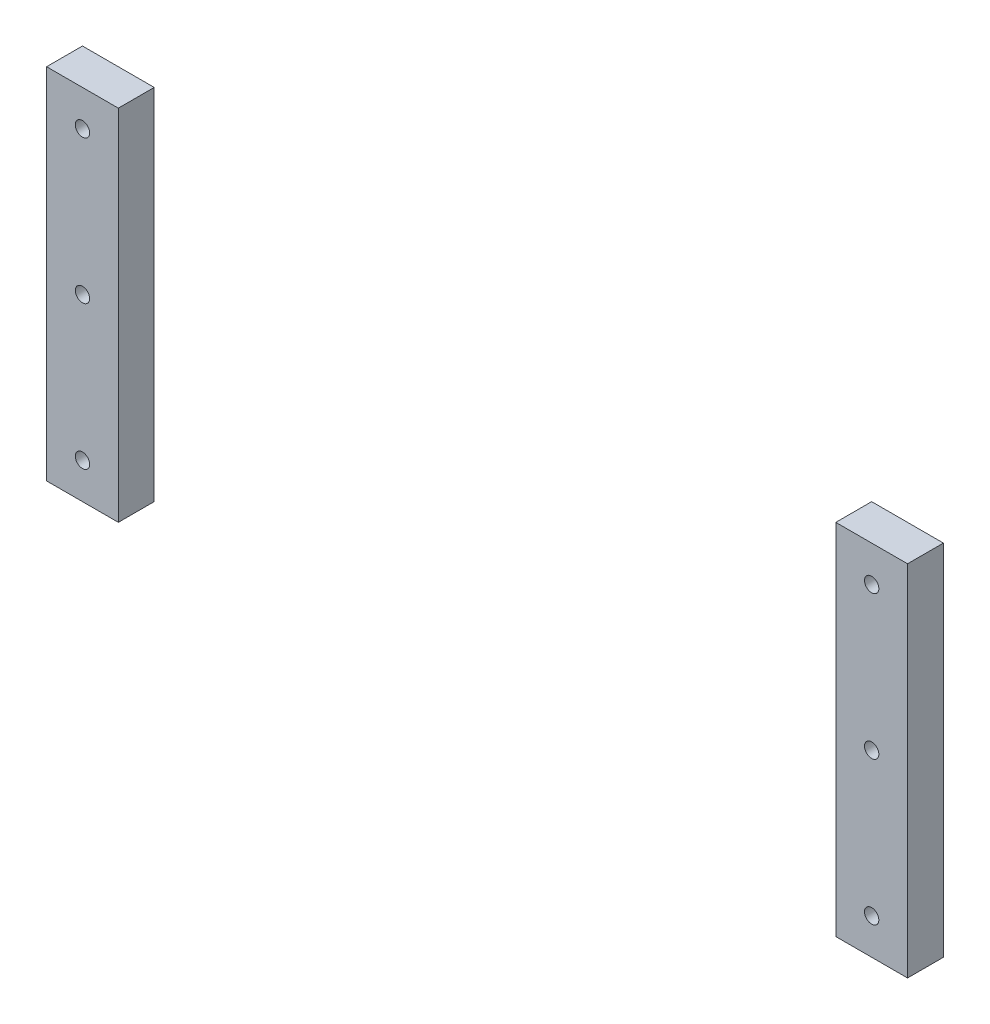
ISO-10303-21;
HEADER;
FILE_DESCRIPTION(('STEP AP214'),'2;1');
FILE_NAME('part.step','',(''),(''),'','','');
FILE_SCHEMA(('AUTOMOTIVE_DESIGN { 1 0 10303 214 1 1 1 1 }'));
ENDSEC;
DATA;
#1=APPLICATION_CONTEXT('core data for automotive mechanical design processes');
#2=APPLICATION_PROTOCOL_DEFINITION('international standard','automotive_design',2000,#1);
#3=PRODUCT_CONTEXT('',#1,'mechanical');
#4=PRODUCT('Part','Part','',(#3));
#5=PRODUCT_RELATED_PRODUCT_CATEGORY('part','',(#4));
#6=PRODUCT_DEFINITION_FORMATION('','',#4);
#7=PRODUCT_DEFINITION_CONTEXT('part definition',#1,'design');
#8=PRODUCT_DEFINITION('design','',#6,#7);
#9=PRODUCT_DEFINITION_SHAPE('','',#8);
#10=(LENGTH_UNIT() NAMED_UNIT(*) SI_UNIT(.MILLI.,.METRE.));
#11=(NAMED_UNIT(*) PLANE_ANGLE_UNIT() SI_UNIT($,.RADIAN.));
#12=(NAMED_UNIT(*) SI_UNIT($,.STERADIAN.) SOLID_ANGLE_UNIT());
#13=UNCERTAINTY_MEASURE_WITH_UNIT(LENGTH_MEASURE(1.E-05),#10,'distance_accuracy_value','');
#14=(GEOMETRIC_REPRESENTATION_CONTEXT(3) GLOBAL_UNCERTAINTY_ASSIGNED_CONTEXT((#13)) GLOBAL_UNIT_ASSIGNED_CONTEXT((#10,
#11,#12)) REPRESENTATION_CONTEXT('',''));
#15=CARTESIAN_POINT('',(0.,0.,0.));
#16=DIRECTION('',(0.,0.,1.));
#17=DIRECTION('',(1.,0.,0.));
#18=AXIS2_PLACEMENT_3D('',#15,#16,#17);
#19=CARTESIAN_POINT('',(200.,0.,10.));
#20=DIRECTION('',(1.,0.,0.));
#21=DIRECTION('',(0.,0.,-1.));
#22=AXIS2_PLACEMENT_3D('',#19,#20,#21);
#23=PLANE('',#22);
#24=DIRECTION('',(0.,-1.,0.));
#25=VECTOR('',#24,1.);
#26=CARTESIAN_POINT('',(200.,0.,0.));
#27=LINE('',#26,#25);
#28=CARTESIAN_POINT('',(200.,100.,0.));
#29=VERTEX_POINT('',#28);
#30=CARTESIAN_POINT('',(200.,0.,0.));
#31=VERTEX_POINT('',#30);
#32=EDGE_CURVE('E110',#29,#31,#27,.T.);
#33=ORIENTED_EDGE('',*,*,#32,.T.);
#34=DIRECTION('',(0.,0.,-1.));
#35=VECTOR('',#34,1.);
#36=CARTESIAN_POINT('',(200.,0.,10.));
#37=LINE('',#36,#35);
#38=CARTESIAN_POINT('',(200.,0.,10.));
#39=VERTEX_POINT('',#38);
#40=EDGE_CURVE('E12',#39,#31,#37,.T.);
#41=ORIENTED_EDGE('',*,*,#40,.F.);
#42=DIRECTION('',(0.,-1.,0.));
#43=VECTOR('',#42,1.);
#44=CARTESIAN_POINT('',(200.,0.,10.));
#45=LINE('',#44,#43);
#46=CARTESIAN_POINT('',(200.,100.,10.));
#47=VERTEX_POINT('',#46);
#48=EDGE_CURVE('E98',#47,#39,#45,.T.);
#49=ORIENTED_EDGE('',*,*,#48,.F.);
#50=DIRECTION('',(0.,0.,-1.));
#51=VECTOR('',#50,1.);
#52=CARTESIAN_POINT('',(200.,100.,10.));
#53=LINE('',#52,#51);
#54=EDGE_CURVE('E106',#47,#29,#53,.T.);
#55=ORIENTED_EDGE('',*,*,#54,.T.);
#56=EDGE_LOOP('',(#33,#41,#49,#55));
#57=FACE_BOUND('',#56,.T.);
#58=ADVANCED_FACE('F47',(#57),#23,.F.);
#59=CARTESIAN_POINT('',(200.,0.,10.));
#60=DIRECTION('',(0.,1.,0.));
#61=DIRECTION('',(0.,0.,1.));
#62=AXIS2_PLACEMENT_3D('',#59,#60,#61);
#63=PLANE('',#62);
#64=DIRECTION('',(1.,0.,0.));
#65=VECTOR('',#64,1.);
#66=CARTESIAN_POINT('',(200.,0.,0.));
#67=LINE('',#66,#65);
#68=CARTESIAN_POINT('',(220.,0.,0.));
#69=VERTEX_POINT('',#68);
#70=EDGE_CURVE('E102',#31,#69,#67,.T.);
#71=ORIENTED_EDGE('',*,*,#70,.T.);
#72=DIRECTION('',(0.,0.,-1.));
#73=VECTOR('',#72,1.);
#74=CARTESIAN_POINT('',(220.,0.,10.));
#75=LINE('',#74,#73);
#76=CARTESIAN_POINT('',(220.,0.,10.));
#77=VERTEX_POINT('',#76);
#78=EDGE_CURVE('E55',#77,#69,#75,.T.);
#79=ORIENTED_EDGE('',*,*,#78,.F.);
#80=DIRECTION('',(1.,0.,0.));
#81=VECTOR('',#80,1.);
#82=CARTESIAN_POINT('',(200.,0.,10.));
#83=LINE('',#82,#81);
#84=EDGE_CURVE('E93',#39,#77,#83,.T.);
#85=ORIENTED_EDGE('',*,*,#84,.F.);
#86=ORIENTED_EDGE('',*,*,#40,.T.);
#87=EDGE_LOOP('',(#71,#79,#85,#86));
#88=FACE_BOUND('',#87,.T.);
#89=ADVANCED_FACE('F101',(#88),#63,.F.);
#90=CARTESIAN_POINT('',(220.,0.,10.));
#91=DIRECTION('',(-1.,0.,0.));
#92=DIRECTION('',(0.,0.,1.));
#93=AXIS2_PLACEMENT_3D('',#90,#91,#92);
#94=PLANE('',#93);
#95=DIRECTION('',(0.,1.,0.));
#96=VECTOR('',#95,1.);
#97=CARTESIAN_POINT('',(220.,0.,0.));
#98=LINE('',#97,#96);
#99=CARTESIAN_POINT('',(220.,100.,0.));
#100=VERTEX_POINT('',#99);
#101=EDGE_CURVE('E80',#69,#100,#98,.T.);
#102=ORIENTED_EDGE('',*,*,#101,.T.);
#103=DIRECTION('',(0.,0.,-1.));
#104=VECTOR('',#103,1.);
#105=CARTESIAN_POINT('',(220.,100.,10.));
#106=LINE('',#105,#104);
#107=CARTESIAN_POINT('',(220.,100.,10.));
#108=VERTEX_POINT('',#107);
#109=EDGE_CURVE('E103',#108,#100,#106,.T.);
#110=ORIENTED_EDGE('',*,*,#109,.F.);
#111=DIRECTION('',(0.,1.,0.));
#112=VECTOR('',#111,1.);
#113=CARTESIAN_POINT('',(220.,0.,10.));
#114=LINE('',#113,#112);
#115=EDGE_CURVE('E96',#77,#108,#114,.T.);
#116=ORIENTED_EDGE('',*,*,#115,.F.);
#117=ORIENTED_EDGE('',*,*,#78,.T.);
#118=EDGE_LOOP('',(#102,#110,#116,#117));
#119=FACE_BOUND('',#118,.T.);
#120=ADVANCED_FACE('F104',(#119),#94,.F.);
#121=CARTESIAN_POINT('',(200.,100.,10.));
#122=DIRECTION('',(0.,-1.,0.));
#123=DIRECTION('',(0.,0.,-1.));
#124=AXIS2_PLACEMENT_3D('',#121,#122,#123);
#125=PLANE('',#124);
#126=DIRECTION('',(-1.,0.,0.));
#127=VECTOR('',#126,1.);
#128=CARTESIAN_POINT('',(200.,100.,0.));
#129=LINE('',#128,#127);
#130=EDGE_CURVE('E86',#100,#29,#129,.T.);
#131=ORIENTED_EDGE('',*,*,#130,.T.);
#132=ORIENTED_EDGE('',*,*,#54,.F.);
#133=DIRECTION('',(-1.,0.,0.));
#134=VECTOR('',#133,1.);
#135=CARTESIAN_POINT('',(200.,100.,10.));
#136=LINE('',#135,#134);
#137=EDGE_CURVE('E63',#108,#47,#136,.T.);
#138=ORIENTED_EDGE('',*,*,#137,.F.);
#139=ORIENTED_EDGE('',*,*,#109,.T.);
#140=EDGE_LOOP('',(#131,#132,#138,#139));
#141=FACE_BOUND('',#140,.T.);
#142=ADVANCED_FACE('F118',(#141),#125,.F.);
#143=CARTESIAN_POINT('',(0.,0.,10.));
#144=DIRECTION('',(0.,0.,-1.));
#145=DIRECTION('',(-1.,0.,0.));
#146=AXIS2_PLACEMENT_3D('',#143,#144,#145);
#147=PLANE('',#146);
#148=CARTESIAN_POINT('',(210.,10.,10.));
#149=DIRECTION('',(0.,0.,1.));
#150=DIRECTION('',(-1.,0.,0.));
#151=AXIS2_PLACEMENT_3D('',#148,#149,#150);
#152=CIRCLE('',#151,2.);
#153=CARTESIAN_POINT('',(208.,10.,10.));
#154=VERTEX_POINT('',#153);
#155=EDGE_CURVE('E136',#154,#154,#152,.T.);
#156=ORIENTED_EDGE('',*,*,#155,.F.);
#157=EDGE_LOOP('',(#156));
#158=FACE_BOUND('',#157,.T.);
#159=CARTESIAN_POINT('',(210.,50.,10.));
#160=DIRECTION('',(0.,0.,1.));
#161=DIRECTION('',(-1.,0.,0.));
#162=AXIS2_PLACEMENT_3D('',#159,#160,#161);
#163=CIRCLE('',#162,1.99999999999997);
#164=CARTESIAN_POINT('',(208.,50.,10.));
#165=VERTEX_POINT('',#164);
#166=EDGE_CURVE('E130',#165,#165,#163,.T.);
#167=ORIENTED_EDGE('',*,*,#166,.F.);
#168=EDGE_LOOP('',(#167));
#169=FACE_BOUND('',#168,.T.);
#170=CARTESIAN_POINT('',(210.,90.,10.));
#171=DIRECTION('',(0.,0.,1.));
#172=DIRECTION('',(-1.,0.,0.));
#173=AXIS2_PLACEMENT_3D('',#170,#171,#172);
#174=CIRCLE('',#173,2.00000000000002);
#175=CARTESIAN_POINT('',(208.,90.,10.));
#176=VERTEX_POINT('',#175);
#177=EDGE_CURVE('E124',#176,#176,#174,.T.);
#178=ORIENTED_EDGE('',*,*,#177,.F.);
#179=EDGE_LOOP('',(#178));
#180=FACE_BOUND('',#179,.T.);
#181=ORIENTED_EDGE('',*,*,#48,.T.);
#182=ORIENTED_EDGE('',*,*,#84,.T.);
#183=ORIENTED_EDGE('',*,*,#115,.T.);
#184=ORIENTED_EDGE('',*,*,#137,.T.);
#185=EDGE_LOOP('',(#181,#182,#183,#184));
#186=FACE_BOUND('',#185,.T.);
#187=ADVANCED_FACE('F94',(#158,#169,#180,#186),#147,.F.);
#188=CARTESIAN_POINT('',(0.,0.,0.));
#189=DIRECTION('',(0.,0.,-1.));
#190=DIRECTION('',(-1.,0.,0.));
#191=AXIS2_PLACEMENT_3D('',#188,#189,#190);
#192=PLANE('',#191);
#193=CARTESIAN_POINT('',(210.,10.,0.));
#194=DIRECTION('',(0.,0.,1.));
#195=DIRECTION('',(-1.,0.,0.));
#196=AXIS2_PLACEMENT_3D('',#193,#194,#195);
#197=CIRCLE('',#196,2.);
#198=CARTESIAN_POINT('',(208.,10.,0.));
#199=VERTEX_POINT('',#198);
#200=EDGE_CURVE('E113',#199,#199,#197,.T.);
#201=ORIENTED_EDGE('',*,*,#200,.T.);
#202=EDGE_LOOP('',(#201));
#203=FACE_BOUND('',#202,.T.);
#204=CARTESIAN_POINT('',(210.,50.,0.));
#205=DIRECTION('',(0.,0.,1.));
#206=DIRECTION('',(-1.,0.,0.));
#207=AXIS2_PLACEMENT_3D('',#204,#205,#206);
#208=CIRCLE('',#207,1.99999999999997);
#209=CARTESIAN_POINT('',(208.,50.,0.));
#210=VERTEX_POINT('',#209);
#211=EDGE_CURVE('E133',#210,#210,#208,.T.);
#212=ORIENTED_EDGE('',*,*,#211,.T.);
#213=EDGE_LOOP('',(#212));
#214=FACE_BOUND('',#213,.T.);
#215=CARTESIAN_POINT('',(210.,90.,0.));
#216=DIRECTION('',(0.,0.,1.));
#217=DIRECTION('',(-1.,0.,0.));
#218=AXIS2_PLACEMENT_3D('',#215,#216,#217);
#219=CIRCLE('',#218,2.00000000000002);
#220=CARTESIAN_POINT('',(208.,90.,0.));
#221=VERTEX_POINT('',#220);
#222=EDGE_CURVE('E127',#221,#221,#219,.T.);
#223=ORIENTED_EDGE('',*,*,#222,.T.);
#224=EDGE_LOOP('',(#223));
#225=FACE_BOUND('',#224,.T.);
#226=ORIENTED_EDGE('',*,*,#32,.F.);
#227=ORIENTED_EDGE('',*,*,#130,.F.);
#228=ORIENTED_EDGE('',*,*,#101,.F.);
#229=ORIENTED_EDGE('',*,*,#70,.F.);
#230=EDGE_LOOP('',(#226,#227,#228,#229));
#231=FACE_BOUND('',#230,.T.);
#232=ADVANCED_FACE('F121',(#203,#214,#225,#231),#192,.T.);
#233=CARTESIAN_POINT('',(210.,90.,0.));
#234=DIRECTION('',(0.,0.,1.));
#235=DIRECTION('',(1.,0.,0.));
#236=AXIS2_PLACEMENT_3D('',#233,#234,#235);
#237=CYLINDRICAL_SURFACE('',#236,2.00000000000002);
#238=ORIENTED_EDGE('',*,*,#222,.F.);
#239=EDGE_LOOP('',(#238));
#240=FACE_BOUND('',#239,.T.);
#241=ORIENTED_EDGE('',*,*,#177,.T.);
#242=EDGE_LOOP('',(#241));
#243=FACE_BOUND('',#242,.T.);
#244=ADVANCED_FACE('F158',(#240,#243),#237,.F.);
#245=CARTESIAN_POINT('',(210.,50.,0.));
#246=DIRECTION('',(0.,0.,1.));
#247=DIRECTION('',(1.,0.,0.));
#248=AXIS2_PLACEMENT_3D('',#245,#246,#247);
#249=CYLINDRICAL_SURFACE('',#248,1.99999999999997);
#250=ORIENTED_EDGE('',*,*,#211,.F.);
#251=EDGE_LOOP('',(#250));
#252=FACE_BOUND('',#251,.T.);
#253=ORIENTED_EDGE('',*,*,#166,.T.);
#254=EDGE_LOOP('',(#253));
#255=FACE_BOUND('',#254,.T.);
#256=ADVANCED_FACE('F147',(#252,#255),#249,.F.);
#257=CARTESIAN_POINT('',(210.,10.,0.));
#258=DIRECTION('',(0.,0.,1.));
#259=DIRECTION('',(1.,0.,0.));
#260=AXIS2_PLACEMENT_3D('',#257,#258,#259);
#261=CYLINDRICAL_SURFACE('',#260,2.);
#262=ORIENTED_EDGE('',*,*,#200,.F.);
#263=EDGE_LOOP('',(#262));
#264=FACE_BOUND('',#263,.T.);
#265=ORIENTED_EDGE('',*,*,#155,.T.);
#266=EDGE_LOOP('',(#265));
#267=FACE_BOUND('',#266,.T.);
#268=ADVANCED_FACE('F144',(#264,#267),#261,.F.);
#269=CLOSED_SHELL('',(#58,#89,#120,#142,#187,#232,#244,#256,#268));
#270=MANIFOLD_SOLID_BREP('B2',#269);
#271=CARTESIAN_POINT('',(-20.,0.,10.));
#272=DIRECTION('',(1.,0.,0.));
#273=DIRECTION('',(0.,1.,0.));
#274=AXIS2_PLACEMENT_3D('',#271,#272,#273);
#275=PLANE('',#274);
#276=DIRECTION('',(0.,-1.,0.));
#277=VECTOR('',#276,1.);
#278=CARTESIAN_POINT('',(-20.,0.,0.));
#279=LINE('',#278,#277);
#280=CARTESIAN_POINT('',(-20.,100.,0.));
#281=VERTEX_POINT('',#280);
#282=CARTESIAN_POINT('',(-20.,0.,0.));
#283=VERTEX_POINT('',#282);
#284=EDGE_CURVE('E297',#281,#283,#279,.T.);
#285=ORIENTED_EDGE('',*,*,#284,.T.);
#286=DIRECTION('',(0.,0.,-1.));
#287=VECTOR('',#286,1.);
#288=CARTESIAN_POINT('',(-20.,0.,10.));
#289=LINE('',#288,#287);
#290=CARTESIAN_POINT('',(-20.,0.,10.));
#291=VERTEX_POINT('',#290);
#292=EDGE_CURVE('E45',#291,#283,#289,.T.);
#293=ORIENTED_EDGE('',*,*,#292,.F.);
#294=DIRECTION('',(0.,-1.,0.));
#295=VECTOR('',#294,1.);
#296=CARTESIAN_POINT('',(-20.,0.,10.));
#297=LINE('',#296,#295);
#298=CARTESIAN_POINT('',(-20.,100.,10.));
#299=VERTEX_POINT('',#298);
#300=EDGE_CURVE('E285',#299,#291,#297,.T.);
#301=ORIENTED_EDGE('',*,*,#300,.F.);
#302=DIRECTION('',(0.,0.,-1.));
#303=VECTOR('',#302,1.);
#304=CARTESIAN_POINT('',(-20.,100.,10.));
#305=LINE('',#304,#303);
#306=EDGE_CURVE('E293',#299,#281,#305,.T.);
#307=ORIENTED_EDGE('',*,*,#306,.T.);
#308=EDGE_LOOP('',(#285,#293,#301,#307));
#309=FACE_BOUND('',#308,.T.);
#310=ADVANCED_FACE('F234',(#309),#275,.F.);
#311=CARTESIAN_POINT('',(-20.,0.,10.));
#312=DIRECTION('',(0.,1.,0.));
#313=DIRECTION('',(0.,0.,1.));
#314=AXIS2_PLACEMENT_3D('',#311,#312,#313);
#315=PLANE('',#314);
#316=DIRECTION('',(1.,0.,0.));
#317=VECTOR('',#316,1.);
#318=CARTESIAN_POINT('',(-20.,0.,0.));
#319=LINE('',#318,#317);
#320=CARTESIAN_POINT('',(0.,0.,0.));
#321=VERTEX_POINT('',#320);
#322=EDGE_CURVE('E289',#283,#321,#319,.T.);
#323=ORIENTED_EDGE('',*,*,#322,.T.);
#324=DIRECTION('',(0.,0.,-1.));
#325=VECTOR('',#324,1.);
#326=CARTESIAN_POINT('',(0.,0.,10.));
#327=LINE('',#326,#325);
#328=CARTESIAN_POINT('',(0.,0.,10.));
#329=VERTEX_POINT('',#328);
#330=EDGE_CURVE('E242',#329,#321,#327,.T.);
#331=ORIENTED_EDGE('',*,*,#330,.F.);
#332=DIRECTION('',(1.,0.,0.));
#333=VECTOR('',#332,1.);
#334=CARTESIAN_POINT('',(-20.,0.,10.));
#335=LINE('',#334,#333);
#336=EDGE_CURVE('E280',#291,#329,#335,.T.);
#337=ORIENTED_EDGE('',*,*,#336,.F.);
#338=ORIENTED_EDGE('',*,*,#292,.T.);
#339=EDGE_LOOP('',(#323,#331,#337,#338));
#340=FACE_BOUND('',#339,.T.);
#341=ADVANCED_FACE('F288',(#340),#315,.F.);
#342=CARTESIAN_POINT('',(0.,0.,10.));
#343=DIRECTION('',(-1.,0.,0.));
#344=DIRECTION('',(0.,-1.,0.));
#345=AXIS2_PLACEMENT_3D('',#342,#343,#344);
#346=PLANE('',#345);
#347=DIRECTION('',(0.,1.,0.));
#348=VECTOR('',#347,1.);
#349=CARTESIAN_POINT('',(0.,0.,0.));
#350=LINE('',#349,#348);
#351=CARTESIAN_POINT('',(0.,100.,0.));
#352=VERTEX_POINT('',#351);
#353=EDGE_CURVE('E267',#321,#352,#350,.T.);
#354=ORIENTED_EDGE('',*,*,#353,.T.);
#355=DIRECTION('',(0.,0.,-1.));
#356=VECTOR('',#355,1.);
#357=CARTESIAN_POINT('',(0.,100.,10.));
#358=LINE('',#357,#356);
#359=CARTESIAN_POINT('',(0.,100.,10.));
#360=VERTEX_POINT('',#359);
#361=EDGE_CURVE('E290',#360,#352,#358,.T.);
#362=ORIENTED_EDGE('',*,*,#361,.F.);
#363=DIRECTION('',(0.,1.,0.));
#364=VECTOR('',#363,1.);
#365=CARTESIAN_POINT('',(0.,0.,10.));
#366=LINE('',#365,#364);
#367=EDGE_CURVE('E283',#329,#360,#366,.T.);
#368=ORIENTED_EDGE('',*,*,#367,.F.);
#369=ORIENTED_EDGE('',*,*,#330,.T.);
#370=EDGE_LOOP('',(#354,#362,#368,#369));
#371=FACE_BOUND('',#370,.T.);
#372=ADVANCED_FACE('F291',(#371),#346,.F.);
#373=CARTESIAN_POINT('',(-20.,100.,10.));
#374=DIRECTION('',(0.,-1.,0.));
#375=DIRECTION('',(0.,0.,-1.));
#376=AXIS2_PLACEMENT_3D('',#373,#374,#375);
#377=PLANE('',#376);
#378=DIRECTION('',(-1.,0.,0.));
#379=VECTOR('',#378,1.);
#380=CARTESIAN_POINT('',(-20.,100.,0.));
#381=LINE('',#380,#379);
#382=EDGE_CURVE('E273',#352,#281,#381,.T.);
#383=ORIENTED_EDGE('',*,*,#382,.T.);
#384=ORIENTED_EDGE('',*,*,#306,.F.);
#385=DIRECTION('',(-1.,0.,0.));
#386=VECTOR('',#385,1.);
#387=CARTESIAN_POINT('',(-20.,100.,10.));
#388=LINE('',#387,#386);
#389=EDGE_CURVE('E250',#360,#299,#388,.T.);
#390=ORIENTED_EDGE('',*,*,#389,.F.);
#391=ORIENTED_EDGE('',*,*,#361,.T.);
#392=EDGE_LOOP('',(#383,#384,#390,#391));
#393=FACE_BOUND('',#392,.T.);
#394=ADVANCED_FACE('F305',(#393),#377,.F.);
#395=CARTESIAN_POINT('',(0.,0.,10.));
#396=DIRECTION('',(0.,0.,-1.));
#397=DIRECTION('',(-1.,0.,0.));
#398=AXIS2_PLACEMENT_3D('',#395,#396,#397);
#399=PLANE('',#398);
#400=CARTESIAN_POINT('',(-9.99999999999998,10.,10.));
#401=DIRECTION('',(0.,0.,1.));
#402=DIRECTION('',(1.,0.,0.));
#403=AXIS2_PLACEMENT_3D('',#400,#401,#402);
#404=CIRCLE('',#403,2.);
#405=CARTESIAN_POINT('',(-7.99999999999998,10.,10.));
#406=VERTEX_POINT('',#405);
#407=EDGE_CURVE('E323',#406,#406,#404,.T.);
#408=ORIENTED_EDGE('',*,*,#407,.F.);
#409=EDGE_LOOP('',(#408));
#410=FACE_BOUND('',#409,.T.);
#411=CARTESIAN_POINT('',(-10.,50.,10.));
#412=DIRECTION('',(0.,0.,1.));
#413=DIRECTION('',(1.,0.,0.));
#414=AXIS2_PLACEMENT_3D('',#411,#412,#413);
#415=CIRCLE('',#414,2.);
#416=CARTESIAN_POINT('',(-8.,50.,10.));
#417=VERTEX_POINT('',#416);
#418=EDGE_CURVE('E317',#417,#417,#415,.T.);
#419=ORIENTED_EDGE('',*,*,#418,.F.);
#420=EDGE_LOOP('',(#419));
#421=FACE_BOUND('',#420,.T.);
#422=CARTESIAN_POINT('',(-9.99999999999999,90.,10.));
#423=DIRECTION('',(0.,0.,1.));
#424=DIRECTION('',(1.,0.,0.));
#425=AXIS2_PLACEMENT_3D('',#422,#423,#424);
#426=CIRCLE('',#425,2.);
#427=CARTESIAN_POINT('',(-7.99999999999999,90.,10.));
#428=VERTEX_POINT('',#427);
#429=EDGE_CURVE('E311',#428,#428,#426,.T.);
#430=ORIENTED_EDGE('',*,*,#429,.F.);
#431=EDGE_LOOP('',(#430));
#432=FACE_BOUND('',#431,.T.);
#433=ORIENTED_EDGE('',*,*,#300,.T.);
#434=ORIENTED_EDGE('',*,*,#336,.T.);
#435=ORIENTED_EDGE('',*,*,#367,.T.);
#436=ORIENTED_EDGE('',*,*,#389,.T.);
#437=EDGE_LOOP('',(#433,#434,#435,#436));
#438=FACE_BOUND('',#437,.T.);
#439=ADVANCED_FACE('F281',(#410,#421,#432,#438),#399,.F.);
#440=CARTESIAN_POINT('',(0.,0.,0.));
#441=DIRECTION('',(0.,0.,-1.));
#442=DIRECTION('',(-1.,0.,0.));
#443=AXIS2_PLACEMENT_3D('',#440,#441,#442);
#444=PLANE('',#443);
#445=CARTESIAN_POINT('',(-9.99999999999998,10.,0.));
#446=DIRECTION('',(0.,0.,1.));
#447=DIRECTION('',(1.,0.,0.));
#448=AXIS2_PLACEMENT_3D('',#445,#446,#447);
#449=CIRCLE('',#448,2.);
#450=CARTESIAN_POINT('',(-7.99999999999998,10.,0.));
#451=VERTEX_POINT('',#450);
#452=EDGE_CURVE('E300',#451,#451,#449,.T.);
#453=ORIENTED_EDGE('',*,*,#452,.T.);
#454=EDGE_LOOP('',(#453));
#455=FACE_BOUND('',#454,.T.);
#456=CARTESIAN_POINT('',(-10.,50.,0.));
#457=DIRECTION('',(0.,0.,1.));
#458=DIRECTION('',(1.,0.,0.));
#459=AXIS2_PLACEMENT_3D('',#456,#457,#458);
#460=CIRCLE('',#459,2.);
#461=CARTESIAN_POINT('',(-8.,50.,0.));
#462=VERTEX_POINT('',#461);
#463=EDGE_CURVE('E320',#462,#462,#460,.T.);
#464=ORIENTED_EDGE('',*,*,#463,.T.);
#465=EDGE_LOOP('',(#464));
#466=FACE_BOUND('',#465,.T.);
#467=CARTESIAN_POINT('',(-9.99999999999999,90.,0.));
#468=DIRECTION('',(0.,0.,1.));
#469=DIRECTION('',(1.,0.,0.));
#470=AXIS2_PLACEMENT_3D('',#467,#468,#469);
#471=CIRCLE('',#470,2.);
#472=CARTESIAN_POINT('',(-7.99999999999999,90.,0.));
#473=VERTEX_POINT('',#472);
#474=EDGE_CURVE('E314',#473,#473,#471,.T.);
#475=ORIENTED_EDGE('',*,*,#474,.T.);
#476=EDGE_LOOP('',(#475));
#477=FACE_BOUND('',#476,.T.);
#478=ORIENTED_EDGE('',*,*,#284,.F.);
#479=ORIENTED_EDGE('',*,*,#382,.F.);
#480=ORIENTED_EDGE('',*,*,#353,.F.);
#481=ORIENTED_EDGE('',*,*,#322,.F.);
#482=EDGE_LOOP('',(#478,#479,#480,#481));
#483=FACE_BOUND('',#482,.T.);
#484=ADVANCED_FACE('F308',(#455,#466,#477,#483),#444,.T.);
#485=CARTESIAN_POINT('',(-9.99999999999999,90.,0.));
#486=DIRECTION('',(0.,0.,1.));
#487=DIRECTION('',(1.,0.,0.));
#488=AXIS2_PLACEMENT_3D('',#485,#486,#487);
#489=CYLINDRICAL_SURFACE('',#488,2.);
#490=ORIENTED_EDGE('',*,*,#474,.F.);
#491=EDGE_LOOP('',(#490));
#492=FACE_BOUND('',#491,.T.);
#493=ORIENTED_EDGE('',*,*,#429,.T.);
#494=EDGE_LOOP('',(#493));
#495=FACE_BOUND('',#494,.T.);
#496=ADVANCED_FACE('F345',(#492,#495),#489,.F.);
#497=CARTESIAN_POINT('',(-10.,50.,0.));
#498=DIRECTION('',(0.,0.,1.));
#499=DIRECTION('',(1.,0.,0.));
#500=AXIS2_PLACEMENT_3D('',#497,#498,#499);
#501=CYLINDRICAL_SURFACE('',#500,2.);
#502=ORIENTED_EDGE('',*,*,#463,.F.);
#503=EDGE_LOOP('',(#502));
#504=FACE_BOUND('',#503,.T.);
#505=ORIENTED_EDGE('',*,*,#418,.T.);
#506=EDGE_LOOP('',(#505));
#507=FACE_BOUND('',#506,.T.);
#508=ADVANCED_FACE('F334',(#504,#507),#501,.F.);
#509=CARTESIAN_POINT('',(-9.99999999999998,10.,0.));
#510=DIRECTION('',(0.,0.,1.));
#511=DIRECTION('',(1.,0.,0.));
#512=AXIS2_PLACEMENT_3D('',#509,#510,#511);
#513=CYLINDRICAL_SURFACE('',#512,2.);
#514=ORIENTED_EDGE('',*,*,#452,.F.);
#515=EDGE_LOOP('',(#514));
#516=FACE_BOUND('',#515,.T.);
#517=ORIENTED_EDGE('',*,*,#407,.T.);
#518=EDGE_LOOP('',(#517));
#519=FACE_BOUND('',#518,.T.);
#520=ADVANCED_FACE('F331',(#516,#519),#513,.F.);
#521=CLOSED_SHELL('',(#310,#341,#372,#394,#439,#484,#496,#508,#520));
#522=MANIFOLD_SOLID_BREP('B6',#521);
#523=ADVANCED_BREP_SHAPE_REPRESENTATION('',(#18,#270,#522),#14);
#524=SHAPE_DEFINITION_REPRESENTATION(#9,#523);
ENDSEC;
END-ISO-10303-21;
